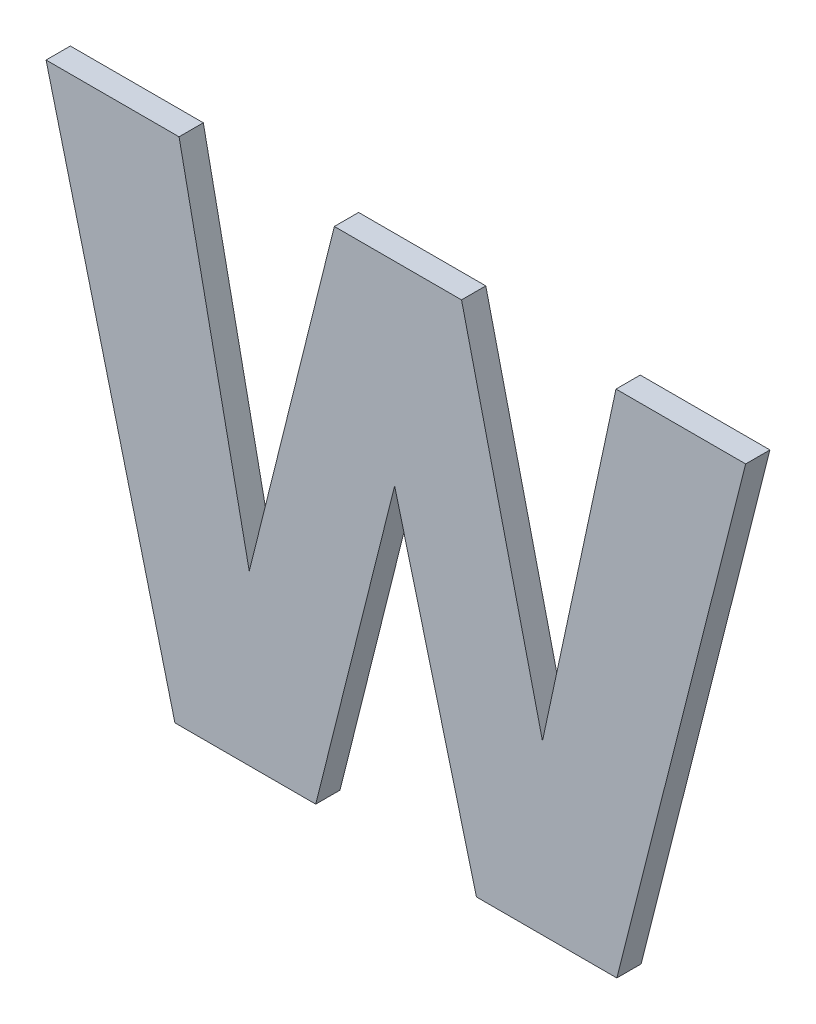
ISO-10303-21;
HEADER;
FILE_DESCRIPTION(('STEP AP214'),'2;1');
FILE_NAME('part.step','',(''),(''),'','','');
FILE_SCHEMA(('AUTOMOTIVE_DESIGN { 1 0 10303 214 1 1 1 1 }'));
ENDSEC;
DATA;
#1=APPLICATION_CONTEXT('core data for automotive mechanical design processes');
#2=APPLICATION_PROTOCOL_DEFINITION('international standard','automotive_design',2000,#1);
#3=PRODUCT_CONTEXT('',#1,'mechanical');
#4=PRODUCT('Part','Part','',(#3));
#5=PRODUCT_RELATED_PRODUCT_CATEGORY('part','',(#4));
#6=PRODUCT_DEFINITION_FORMATION('','',#4);
#7=PRODUCT_DEFINITION_CONTEXT('part definition',#1,'design');
#8=PRODUCT_DEFINITION('design','',#6,#7);
#9=PRODUCT_DEFINITION_SHAPE('','',#8);
#10=(LENGTH_UNIT() NAMED_UNIT(*) SI_UNIT(.MILLI.,.METRE.));
#11=(NAMED_UNIT(*) PLANE_ANGLE_UNIT() SI_UNIT($,.RADIAN.));
#12=(NAMED_UNIT(*) SI_UNIT($,.STERADIAN.) SOLID_ANGLE_UNIT());
#13=UNCERTAINTY_MEASURE_WITH_UNIT(LENGTH_MEASURE(1.E-05),#10,'distance_accuracy_value','');
#14=(GEOMETRIC_REPRESENTATION_CONTEXT(3) GLOBAL_UNCERTAINTY_ASSIGNED_CONTEXT((#13)) GLOBAL_UNIT_ASSIGNED_CONTEXT((#10,
#11,#12)) REPRESENTATION_CONTEXT('',''));
#15=CARTESIAN_POINT('',(0.,0.,0.));
#16=DIRECTION('',(0.,0.,1.));
#17=DIRECTION('',(1.,0.,0.));
#18=AXIS2_PLACEMENT_3D('',#15,#16,#17);
#19=CARTESIAN_POINT('',(3.6096971590501,-3.1855080441471,0.0475));
#20=DIRECTION('',(0.,-1.,0.));
#21=DIRECTION('',(1.,0.,0.));
#22=AXIS2_PLACEMENT_3D('',#19,#20,#21);
#23=PLANE('',#22);
#24=DIRECTION('',(-1.,0.,0.));
#25=VECTOR('',#24,1.);
#26=CARTESIAN_POINT('',(3.6386274660885,-3.1855080441471,0.0475));
#27=LINE('',#26,#25);
#28=CARTESIAN_POINT('',(3.6386274660885,-3.1855080441471,0.0475));
#29=VERTEX_POINT('',#28);
#30=CARTESIAN_POINT('',(3.6096971590501,-3.1855080441471,0.0475));
#31=VERTEX_POINT('',#30);
#32=EDGE_CURVE('E11',#29,#31,#27,.T.);
#33=ORIENTED_EDGE('',*,*,#32,.F.);
#34=DIRECTION('',(0.,0.,1.));
#35=VECTOR('',#34,1.);
#36=CARTESIAN_POINT('',(3.6386274660885,-3.1855080441471,0.0475));
#37=LINE('',#36,#35);
#38=CARTESIAN_POINT('',(3.6386274660885,-3.1855080441471,0.0525));
#39=VERTEX_POINT('',#38);
#40=EDGE_CURVE('E24',#29,#39,#37,.T.);
#41=ORIENTED_EDGE('',*,*,#40,.T.);
#42=DIRECTION('',(1.,0.,0.));
#43=VECTOR('',#42,1.);
#44=CARTESIAN_POINT('',(3.6386274660885,-3.1855080441471,0.0525));
#45=LINE('',#44,#43);
#46=CARTESIAN_POINT('',(3.6096971590501,-3.1855080441471,0.0525));
#47=VERTEX_POINT('',#46);
#48=EDGE_CURVE('E130',#47,#39,#45,.T.);
#49=ORIENTED_EDGE('',*,*,#48,.F.);
#50=DIRECTION('',(0.,0.,1.));
#51=VECTOR('',#50,1.);
#52=CARTESIAN_POINT('',(3.6096971590501,-3.1855080441471,0.0475));
#53=LINE('',#52,#51);
#54=EDGE_CURVE('E211',#31,#47,#53,.T.);
#55=ORIENTED_EDGE('',*,*,#54,.F.);
#56=EDGE_LOOP('',(#33,#41,#49,#55));
#57=FACE_BOUND('',#56,.T.);
#58=ADVANCED_FACE('F17',(#57),#23,.T.);
#59=CARTESIAN_POINT('',(3.5928495096571,-3.1205850315874,0.0475));
#60=DIRECTION('',(-0.967939802559994,-0.251182281660392,0.));
#61=DIRECTION('',(0.251182281660392,-0.967939802559994,0.));
#62=AXIS2_PLACEMENT_3D('',#59,#60,#61);
#63=PLANE('',#62);
#64=DIRECTION('',(-0.251182281660392,0.967939802559994,0.));
#65=VECTOR('',#64,1.);
#66=CARTESIAN_POINT('',(3.6096971590501,-3.1855080441471,0.0475));
#67=LINE('',#66,#65);
#68=CARTESIAN_POINT('',(3.5928495096571,-3.1205850315874,0.0475));
#69=VERTEX_POINT('',#68);
#70=EDGE_CURVE('E209',#31,#69,#67,.T.);
#71=ORIENTED_EDGE('',*,*,#70,.F.);
#72=ORIENTED_EDGE('',*,*,#54,.T.);
#73=DIRECTION('',(0.251182281660392,-0.967939802559994,0.));
#74=VECTOR('',#73,1.);
#75=CARTESIAN_POINT('',(3.6096971590501,-3.1855080441471,0.0525));
#76=LINE('',#75,#74);
#77=CARTESIAN_POINT('',(3.5928495096571,-3.1205850315874,0.0525));
#78=VERTEX_POINT('',#77);
#79=EDGE_CURVE('E207',#78,#47,#76,.T.);
#80=ORIENTED_EDGE('',*,*,#79,.F.);
#81=DIRECTION('',(0.,0.,1.));
#82=VECTOR('',#81,1.);
#83=CARTESIAN_POINT('',(3.5928495096571,-3.1205850315874,0.0475));
#84=LINE('',#83,#82);
#85=EDGE_CURVE('E204',#69,#78,#84,.T.);
#86=ORIENTED_EDGE('',*,*,#85,.F.);
#87=EDGE_LOOP('',(#71,#72,#80,#86));
#88=FACE_BOUND('',#87,.T.);
#89=ADVANCED_FACE('F253',(#88),#63,.T.);
#90=CARTESIAN_POINT('',(3.5765974842326,-3.1855080441471,0.0475));
#91=DIRECTION('',(0.970067666599742,-0.242834763198625,0.));
#92=DIRECTION('',(0.242834763198625,0.970067666599742,0.));
#93=AXIS2_PLACEMENT_3D('',#90,#91,#92);
#94=PLANE('',#93);
#95=DIRECTION('',(-0.242834763198625,-0.970067666599742,0.));
#96=VECTOR('',#95,1.);
#97=CARTESIAN_POINT('',(3.5928495096571,-3.1205850315874,0.0475));
#98=LINE('',#97,#96);
#99=CARTESIAN_POINT('',(3.5765974842326,-3.1855080441471,0.0475));
#100=VERTEX_POINT('',#99);
#101=EDGE_CURVE('E202',#69,#100,#98,.T.);
#102=ORIENTED_EDGE('',*,*,#101,.F.);
#103=ORIENTED_EDGE('',*,*,#85,.T.);
#104=DIRECTION('',(0.242834763198625,0.970067666599742,0.));
#105=VECTOR('',#104,1.);
#106=CARTESIAN_POINT('',(3.5928495096571,-3.1205850315874,0.0525));
#107=LINE('',#106,#105);
#108=CARTESIAN_POINT('',(3.5765974842326,-3.1855080441471,0.0525));
#109=VERTEX_POINT('',#108);
#110=EDGE_CURVE('E199',#109,#78,#107,.T.);
#111=ORIENTED_EDGE('',*,*,#110,.F.);
#112=DIRECTION('',(0.,0.,1.));
#113=VECTOR('',#112,1.);
#114=CARTESIAN_POINT('',(3.5765974842326,-3.1855080441471,0.0475));
#115=LINE('',#114,#113);
#116=EDGE_CURVE('E196',#100,#109,#115,.T.);
#117=ORIENTED_EDGE('',*,*,#116,.F.);
#118=EDGE_LOOP('',(#102,#103,#111,#117));
#119=FACE_BOUND('',#118,.T.);
#120=ADVANCED_FACE('F249',(#119),#94,.T.);
#121=CARTESIAN_POINT('',(3.5475820880559,-3.1855080441471,0.0475));
#122=DIRECTION('',(0.,-1.,0.));
#123=DIRECTION('',(1.,0.,0.));
#124=AXIS2_PLACEMENT_3D('',#121,#122,#123);
#125=PLANE('',#124);
#126=DIRECTION('',(-1.,0.,0.));
#127=VECTOR('',#126,1.);
#128=CARTESIAN_POINT('',(3.5765974842326,-3.1855080441471,0.0475));
#129=LINE('',#128,#127);
#130=CARTESIAN_POINT('',(3.5475820880559,-3.1855080441471,0.0475));
#131=VERTEX_POINT('',#130);
#132=EDGE_CURVE('E194',#100,#131,#129,.T.);
#133=ORIENTED_EDGE('',*,*,#132,.F.);
#134=ORIENTED_EDGE('',*,*,#116,.T.);
#135=DIRECTION('',(1.,0.,0.));
#136=VECTOR('',#135,1.);
#137=CARTESIAN_POINT('',(3.5765974842326,-3.1855080441471,0.0525));
#138=LINE('',#137,#136);
#139=CARTESIAN_POINT('',(3.5475820880559,-3.1855080441471,0.0525));
#140=VERTEX_POINT('',#139);
#141=EDGE_CURVE('E191',#140,#109,#138,.T.);
#142=ORIENTED_EDGE('',*,*,#141,.F.);
#143=DIRECTION('',(0.,0.,1.));
#144=VECTOR('',#143,1.);
#145=CARTESIAN_POINT('',(3.5475820880559,-3.1855080441471,0.0475));
#146=LINE('',#145,#144);
#147=EDGE_CURVE('E188',#131,#140,#146,.T.);
#148=ORIENTED_EDGE('',*,*,#147,.F.);
#149=EDGE_LOOP('',(#133,#134,#142,#148));
#150=FACE_BOUND('',#149,.T.);
#151=ADVANCED_FACE('F245',(#150),#125,.T.);
#152=CARTESIAN_POINT('',(3.5210342768912,-3.0805080474254,0.0475));
#153=DIRECTION('',(-0.969492042294745,-0.245122785410016,0.));
#154=DIRECTION('',(0.245122785410016,-0.969492042294745,0.));
#155=AXIS2_PLACEMENT_3D('',#152,#153,#154);
#156=PLANE('',#155);
#157=DIRECTION('',(-0.245122785410016,0.969492042294745,0.));
#158=VECTOR('',#157,1.);
#159=CARTESIAN_POINT('',(3.5475820880559,-3.1855080441471,0.0475));
#160=LINE('',#159,#158);
#161=CARTESIAN_POINT('',(3.5210342768912,-3.0805080474254,0.0475));
#162=VERTEX_POINT('',#161);
#163=EDGE_CURVE('E186',#131,#162,#160,.T.);
#164=ORIENTED_EDGE('',*,*,#163,.F.);
#165=ORIENTED_EDGE('',*,*,#147,.T.);
#166=DIRECTION('',(0.245122785410016,-0.969492042294745,0.));
#167=VECTOR('',#166,1.);
#168=CARTESIAN_POINT('',(3.5475820880559,-3.1855080441471,0.0525));
#169=LINE('',#168,#167);
#170=CARTESIAN_POINT('',(3.5210342768912,-3.0805080474254,0.0525));
#171=VERTEX_POINT('',#170);
#172=EDGE_CURVE('E183',#171,#140,#169,.T.);
#173=ORIENTED_EDGE('',*,*,#172,.F.);
#174=DIRECTION('',(0.,0.,1.));
#175=VECTOR('',#174,1.);
#176=CARTESIAN_POINT('',(3.5210342768912,-3.0805080474254,0.0475));
#177=LINE('',#176,#175);
#178=EDGE_CURVE('E180',#162,#171,#177,.T.);
#179=ORIENTED_EDGE('',*,*,#178,.F.);
#180=EDGE_LOOP('',(#164,#165,#173,#179));
#181=FACE_BOUND('',#180,.T.);
#182=ADVANCED_FACE('F241',(#181),#156,.T.);
#183=CARTESIAN_POINT('',(3.5484329794394,-3.0805080474254,0.0475));
#184=DIRECTION('',(0.,1.,0.));
#185=DIRECTION('',(-1.,0.,0.));
#186=AXIS2_PLACEMENT_3D('',#183,#184,#185);
#187=PLANE('',#186);
#188=DIRECTION('',(1.,0.,0.));
#189=VECTOR('',#188,1.);
#190=CARTESIAN_POINT('',(3.5210342768912,-3.0805080474254,0.0475));
#191=LINE('',#190,#189);
#192=CARTESIAN_POINT('',(3.5484329794394,-3.0805080474254,0.0475));
#193=VERTEX_POINT('',#192);
#194=EDGE_CURVE('E178',#162,#193,#191,.T.);
#195=ORIENTED_EDGE('',*,*,#194,.F.);
#196=ORIENTED_EDGE('',*,*,#178,.T.);
#197=DIRECTION('',(-1.,0.,0.));
#198=VECTOR('',#197,1.);
#199=CARTESIAN_POINT('',(3.5210342768912,-3.0805080474254,0.0525));
#200=LINE('',#199,#198);
#201=CARTESIAN_POINT('',(3.5484329794394,-3.0805080474254,0.0525));
#202=VERTEX_POINT('',#201);
#203=EDGE_CURVE('E175',#202,#171,#200,.T.);
#204=ORIENTED_EDGE('',*,*,#203,.F.);
#205=DIRECTION('',(0.,0.,1.));
#206=VECTOR('',#205,1.);
#207=CARTESIAN_POINT('',(3.5484329794394,-3.0805080474254,0.0475));
#208=LINE('',#207,#206);
#209=EDGE_CURVE('E172',#193,#202,#208,.T.);
#210=ORIENTED_EDGE('',*,*,#209,.F.);
#211=EDGE_LOOP('',(#195,#196,#204,#210));
#212=FACE_BOUND('',#211,.T.);
#213=ADVANCED_FACE('F237',(#212),#187,.T.);
#214=CARTESIAN_POINT('',(3.5628981329586,-3.150791675701,0.0475));
#215=DIRECTION('',(0.979470817900496,0.201586003684121,0.));
#216=DIRECTION('',(-0.201586003684121,0.979470817900496,0.));
#217=AXIS2_PLACEMENT_3D('',#214,#215,#216);
#218=PLANE('',#217);
#219=DIRECTION('',(0.201586003684121,-0.979470817900496,0.));
#220=VECTOR('',#219,1.);
#221=CARTESIAN_POINT('',(3.5484329794394,-3.0805080474254,0.0475));
#222=LINE('',#221,#220);
#223=CARTESIAN_POINT('',(3.5628981329586,-3.150791675701,0.0475));
#224=VERTEX_POINT('',#223);
#225=EDGE_CURVE('E170',#193,#224,#222,.T.);
#226=ORIENTED_EDGE('',*,*,#225,.F.);
#227=ORIENTED_EDGE('',*,*,#209,.T.);
#228=DIRECTION('',(-0.201586003684121,0.979470817900496,0.));
#229=VECTOR('',#228,1.);
#230=CARTESIAN_POINT('',(3.5484329794394,-3.0805080474254,0.0525));
#231=LINE('',#230,#229);
#232=CARTESIAN_POINT('',(3.5628981329586,-3.150791675701,0.0525));
#233=VERTEX_POINT('',#232);
#234=EDGE_CURVE('E167',#233,#202,#231,.T.);
#235=ORIENTED_EDGE('',*,*,#234,.F.);
#236=DIRECTION('',(0.,0.,1.));
#237=VECTOR('',#236,1.);
#238=CARTESIAN_POINT('',(3.5628981329586,-3.150791675701,0.0475));
#239=LINE('',#238,#237);
#240=EDGE_CURVE('E164',#224,#233,#239,.T.);
#241=ORIENTED_EDGE('',*,*,#240,.F.);
#242=EDGE_LOOP('',(#226,#227,#235,#241));
#243=FACE_BOUND('',#242,.T.);
#244=ADVANCED_FACE('F233',(#243),#218,.T.);
#245=CARTESIAN_POINT('',(3.5804264954583,-3.0805080474254,0.0475));
#246=DIRECTION('',(-0.970280539570891,0.241982798004363,0.));
#247=DIRECTION('',(-0.241982798004363,-0.970280539570891,0.));
#248=AXIS2_PLACEMENT_3D('',#245,#246,#247);
#249=PLANE('',#248);
#250=DIRECTION('',(0.241982798004363,0.970280539570891,0.));
#251=VECTOR('',#250,1.);
#252=CARTESIAN_POINT('',(3.5628981329586,-3.150791675701,0.0475));
#253=LINE('',#252,#251);
#254=CARTESIAN_POINT('',(3.5804264954583,-3.0805080474254,0.0475));
#255=VERTEX_POINT('',#254);
#256=EDGE_CURVE('E162',#224,#255,#253,.T.);
#257=ORIENTED_EDGE('',*,*,#256,.F.);
#258=ORIENTED_EDGE('',*,*,#240,.T.);
#259=DIRECTION('',(-0.241982798004363,-0.970280539570891,0.));
#260=VECTOR('',#259,1.);
#261=CARTESIAN_POINT('',(3.5628981329586,-3.150791675701,0.0525));
#262=LINE('',#261,#260);
#263=CARTESIAN_POINT('',(3.5804264954583,-3.0805080474254,0.0525));
#264=VERTEX_POINT('',#263);
#265=EDGE_CURVE('E159',#264,#233,#262,.T.);
#266=ORIENTED_EDGE('',*,*,#265,.F.);
#267=DIRECTION('',(0.,0.,1.));
#268=VECTOR('',#267,1.);
#269=CARTESIAN_POINT('',(3.5804264954583,-3.0805080474254,0.0475));
#270=LINE('',#269,#268);
#271=EDGE_CURVE('E156',#255,#264,#270,.T.);
#272=ORIENTED_EDGE('',*,*,#271,.F.);
#273=EDGE_LOOP('',(#257,#258,#266,#272));
#274=FACE_BOUND('',#273,.T.);
#275=ADVANCED_FACE('F229',(#274),#249,.T.);
#276=CARTESIAN_POINT('',(3.6066339500696,-3.0805080474254,0.0475));
#277=DIRECTION('',(0.,1.,0.));
#278=DIRECTION('',(-1.,0.,0.));
#279=AXIS2_PLACEMENT_3D('',#276,#277,#278);
#280=PLANE('',#279);
#281=DIRECTION('',(1.,0.,0.));
#282=VECTOR('',#281,1.);
#283=CARTESIAN_POINT('',(3.5804264954583,-3.0805080474254,0.0475));
#284=LINE('',#283,#282);
#285=CARTESIAN_POINT('',(3.6066339500696,-3.0805080474254,0.0475));
#286=VERTEX_POINT('',#285);
#287=EDGE_CURVE('E154',#255,#286,#284,.T.);
#288=ORIENTED_EDGE('',*,*,#287,.F.);
#289=ORIENTED_EDGE('',*,*,#271,.T.);
#290=DIRECTION('',(-1.,0.,0.));
#291=VECTOR('',#290,1.);
#292=CARTESIAN_POINT('',(3.5804264954583,-3.0805080474254,0.0525));
#293=LINE('',#292,#291);
#294=CARTESIAN_POINT('',(3.6066339500696,-3.0805080474254,0.0525));
#295=VERTEX_POINT('',#294);
#296=EDGE_CURVE('E151',#295,#264,#293,.T.);
#297=ORIENTED_EDGE('',*,*,#296,.F.);
#298=DIRECTION('',(0.,0.,1.));
#299=VECTOR('',#298,1.);
#300=CARTESIAN_POINT('',(3.6066339500696,-3.0805080474254,0.0475));
#301=LINE('',#300,#299);
#302=EDGE_CURVE('E148',#286,#295,#301,.T.);
#303=ORIENTED_EDGE('',*,*,#302,.F.);
#304=EDGE_LOOP('',(#288,#289,#297,#303));
#305=FACE_BOUND('',#304,.T.);
#306=ADVANCED_FACE('F225',(#305),#280,.T.);
#307=CARTESIAN_POINT('',(3.6233114211858,-3.1508767648394,0.0475));
#308=DIRECTION('',(0.973045557198136,0.230612973652762,0.));
#309=DIRECTION('',(-0.230612973652762,0.973045557198136,0.));
#310=AXIS2_PLACEMENT_3D('',#307,#308,#309);
#311=PLANE('',#310);
#312=DIRECTION('',(0.230612973652762,-0.973045557198136,0.));
#313=VECTOR('',#312,1.);
#314=CARTESIAN_POINT('',(3.6066339500696,-3.0805080474254,0.0475));
#315=LINE('',#314,#313);
#316=CARTESIAN_POINT('',(3.6233114211858,-3.1508767648394,0.0475));
#317=VERTEX_POINT('',#316);
#318=EDGE_CURVE('E146',#286,#317,#315,.T.);
#319=ORIENTED_EDGE('',*,*,#318,.F.);
#320=ORIENTED_EDGE('',*,*,#302,.T.);
#321=DIRECTION('',(-0.230612973652762,0.973045557198136,0.));
#322=VECTOR('',#321,1.);
#323=CARTESIAN_POINT('',(3.6066339500696,-3.0805080474254,0.0525));
#324=LINE('',#323,#322);
#325=CARTESIAN_POINT('',(3.6233114211858,-3.1508767648394,0.0525));
#326=VERTEX_POINT('',#325);
#327=EDGE_CURVE('E143',#326,#295,#324,.T.);
#328=ORIENTED_EDGE('',*,*,#327,.F.);
#329=DIRECTION('',(0.,0.,1.));
#330=VECTOR('',#329,1.);
#331=CARTESIAN_POINT('',(3.6233114211858,-3.1508767648394,0.0475));
#332=LINE('',#331,#330);
#333=EDGE_CURVE('E140',#317,#326,#332,.T.);
#334=ORIENTED_EDGE('',*,*,#333,.F.);
#335=EDGE_LOOP('',(#319,#320,#328,#334));
#336=FACE_BOUND('',#335,.T.);
#337=ADVANCED_FACE('F221',(#336),#311,.T.);
#338=CARTESIAN_POINT('',(3.6384572878118,-3.0805080474254,0.0475));
#339=DIRECTION('',(-0.977611718635636,0.210417032547936,0.));
#340=DIRECTION('',(-0.210417032547936,-0.977611718635636,0.));
#341=AXIS2_PLACEMENT_3D('',#338,#339,#340);
#342=PLANE('',#341);
#343=DIRECTION('',(0.210417032547936,0.977611718635635,0.));
#344=VECTOR('',#343,1.);
#345=CARTESIAN_POINT('',(3.6233114211858,-3.1508767648394,0.0475));
#346=LINE('',#345,#344);
#347=CARTESIAN_POINT('',(3.6384572878118,-3.0805080474254,0.0475));
#348=VERTEX_POINT('',#347);
#349=EDGE_CURVE('E138',#317,#348,#346,.T.);
#350=ORIENTED_EDGE('',*,*,#349,.F.);
#351=ORIENTED_EDGE('',*,*,#333,.T.);
#352=DIRECTION('',(-0.210417032547936,-0.977611718635635,0.));
#353=VECTOR('',#352,1.);
#354=CARTESIAN_POINT('',(3.6233114211858,-3.1508767648394,0.0525));
#355=LINE('',#354,#353);
#356=CARTESIAN_POINT('',(3.6384572878118,-3.0805080474254,0.0525));
#357=VERTEX_POINT('',#356);
#358=EDGE_CURVE('E136',#357,#326,#355,.T.);
#359=ORIENTED_EDGE('',*,*,#358,.F.);
#360=DIRECTION('',(0.,0.,1.));
#361=VECTOR('',#360,1.);
#362=CARTESIAN_POINT('',(3.6384572878118,-3.0805080474254,0.0475));
#363=LINE('',#362,#361);
#364=EDGE_CURVE('E115',#348,#357,#363,.T.);
#365=ORIENTED_EDGE('',*,*,#364,.F.);
#366=EDGE_LOOP('',(#350,#351,#359,#365));
#367=FACE_BOUND('',#366,.T.);
#368=ADVANCED_FACE('F219',(#367),#342,.T.);
#369=CARTESIAN_POINT('',(3.6651752772532,-3.0805080474254,0.0475));
#370=DIRECTION('',(0.,1.,0.));
#371=DIRECTION('',(-1.,0.,0.));
#372=AXIS2_PLACEMENT_3D('',#369,#370,#371);
#373=PLANE('',#372);
#374=DIRECTION('',(1.,0.,0.));
#375=VECTOR('',#374,1.);
#376=CARTESIAN_POINT('',(3.6384572878118,-3.0805080474254,0.0475));
#377=LINE('',#376,#375);
#378=CARTESIAN_POINT('',(3.6651752772532,-3.0805080474254,0.0475));
#379=VERTEX_POINT('',#378);
#380=EDGE_CURVE('E119',#348,#379,#377,.T.);
#381=ORIENTED_EDGE('',*,*,#380,.F.);
#382=ORIENTED_EDGE('',*,*,#364,.T.);
#383=DIRECTION('',(-1.,0.,0.));
#384=VECTOR('',#383,1.);
#385=CARTESIAN_POINT('',(3.6384572878118,-3.0805080474254,0.0525));
#386=LINE('',#385,#384);
#387=CARTESIAN_POINT('',(3.6651752772532,-3.0805080474254,0.0525));
#388=VERTEX_POINT('',#387);
#389=EDGE_CURVE('E108',#388,#357,#386,.T.);
#390=ORIENTED_EDGE('',*,*,#389,.F.);
#391=DIRECTION('',(0.,0.,1.));
#392=VECTOR('',#391,1.);
#393=CARTESIAN_POINT('',(3.6651752772532,-3.0805080474254,0.0475));
#394=LINE('',#393,#392);
#395=EDGE_CURVE('E112',#379,#388,#394,.T.);
#396=ORIENTED_EDGE('',*,*,#395,.F.);
#397=EDGE_LOOP('',(#381,#382,#390,#396));
#398=FACE_BOUND('',#397,.T.);
#399=ADVANCED_FACE('F111',(#398),#373,.T.);
#400=CARTESIAN_POINT('',(3.6386274660885,-3.1855080441471,0.0475));
#401=DIRECTION('',(0.969492042294745,-0.245122785410017,0.));
#402=DIRECTION('',(0.245122785410017,0.969492042294745,0.));
#403=AXIS2_PLACEMENT_3D('',#400,#401,#402);
#404=PLANE('',#403);
#405=DIRECTION('',(-0.245122785410017,-0.969492042294745,0.));
#406=VECTOR('',#405,1.);
#407=CARTESIAN_POINT('',(3.6651752772532,-3.0805080474254,0.0475));
#408=LINE('',#407,#406);
#409=EDGE_CURVE('E125',#379,#29,#408,.T.);
#410=ORIENTED_EDGE('',*,*,#409,.F.);
#411=ORIENTED_EDGE('',*,*,#395,.T.);
#412=DIRECTION('',(0.245122785410017,0.969492042294745,0.));
#413=VECTOR('',#412,1.);
#414=CARTESIAN_POINT('',(3.6651752772532,-3.0805080474254,0.0525));
#415=LINE('',#414,#413);
#416=EDGE_CURVE('E124',#39,#388,#415,.T.);
#417=ORIENTED_EDGE('',*,*,#416,.F.);
#418=ORIENTED_EDGE('',*,*,#40,.F.);
#419=EDGE_LOOP('',(#410,#411,#417,#418));
#420=FACE_BOUND('',#419,.T.);
#421=ADVANCED_FACE('F123',(#420),#404,.T.);
#422=CARTESIAN_POINT('',(3.5931397174914,-3.1285169180552,0.0475));
#423=DIRECTION('',(0.,0.,1.));
#424=DIRECTION('',(1.,0.,0.));
#425=AXIS2_PLACEMENT_3D('',#422,#423,#424);
#426=PLANE('',#425);
#427=ORIENTED_EDGE('',*,*,#409,.T.);
#428=ORIENTED_EDGE('',*,*,#32,.T.);
#429=ORIENTED_EDGE('',*,*,#70,.T.);
#430=ORIENTED_EDGE('',*,*,#101,.T.);
#431=ORIENTED_EDGE('',*,*,#132,.T.);
#432=ORIENTED_EDGE('',*,*,#163,.T.);
#433=ORIENTED_EDGE('',*,*,#194,.T.);
#434=ORIENTED_EDGE('',*,*,#225,.T.);
#435=ORIENTED_EDGE('',*,*,#256,.T.);
#436=ORIENTED_EDGE('',*,*,#287,.T.);
#437=ORIENTED_EDGE('',*,*,#318,.T.);
#438=ORIENTED_EDGE('',*,*,#349,.T.);
#439=ORIENTED_EDGE('',*,*,#380,.T.);
#440=EDGE_LOOP('',(#427,#428,#429,#430,#431,#432,#433,#434,#435,#436,#437,#438,#439));
#441=FACE_BOUND('',#440,.T.);
#442=ADVANCED_FACE('F214',(#441),#426,.F.);
#443=CARTESIAN_POINT('',(3.5931397174914,-3.1285169180552,0.0525));
#444=DIRECTION('',(0.,0.,1.));
#445=DIRECTION('',(1.,0.,0.));
#446=AXIS2_PLACEMENT_3D('',#443,#444,#445);
#447=PLANE('',#446);
#448=ORIENTED_EDGE('',*,*,#416,.T.);
#449=ORIENTED_EDGE('',*,*,#389,.T.);
#450=ORIENTED_EDGE('',*,*,#358,.T.);
#451=ORIENTED_EDGE('',*,*,#327,.T.);
#452=ORIENTED_EDGE('',*,*,#296,.T.);
#453=ORIENTED_EDGE('',*,*,#265,.T.);
#454=ORIENTED_EDGE('',*,*,#234,.T.);
#455=ORIENTED_EDGE('',*,*,#203,.T.);
#456=ORIENTED_EDGE('',*,*,#172,.T.);
#457=ORIENTED_EDGE('',*,*,#141,.T.);
#458=ORIENTED_EDGE('',*,*,#110,.T.);
#459=ORIENTED_EDGE('',*,*,#79,.T.);
#460=ORIENTED_EDGE('',*,*,#48,.T.);
#461=EDGE_LOOP('',(#448,#449,#450,#451,#452,#453,#454,#455,#456,#457,#458,#459,#460));
#462=FACE_BOUND('',#461,.T.);
#463=ADVANCED_FACE('F128',(#462),#447,.T.);
#464=CLOSED_SHELL('',(#58,#89,#120,#151,#182,#213,#244,#275,#306,#337,#368,#399,#421,#442,#463));
#465=MANIFOLD_SOLID_BREP('B1',#464);
#466=ADVANCED_BREP_SHAPE_REPRESENTATION('',(#18,#465),#14);
#467=SHAPE_DEFINITION_REPRESENTATION(#9,#466);
ENDSEC;
END-ISO-10303-21;
